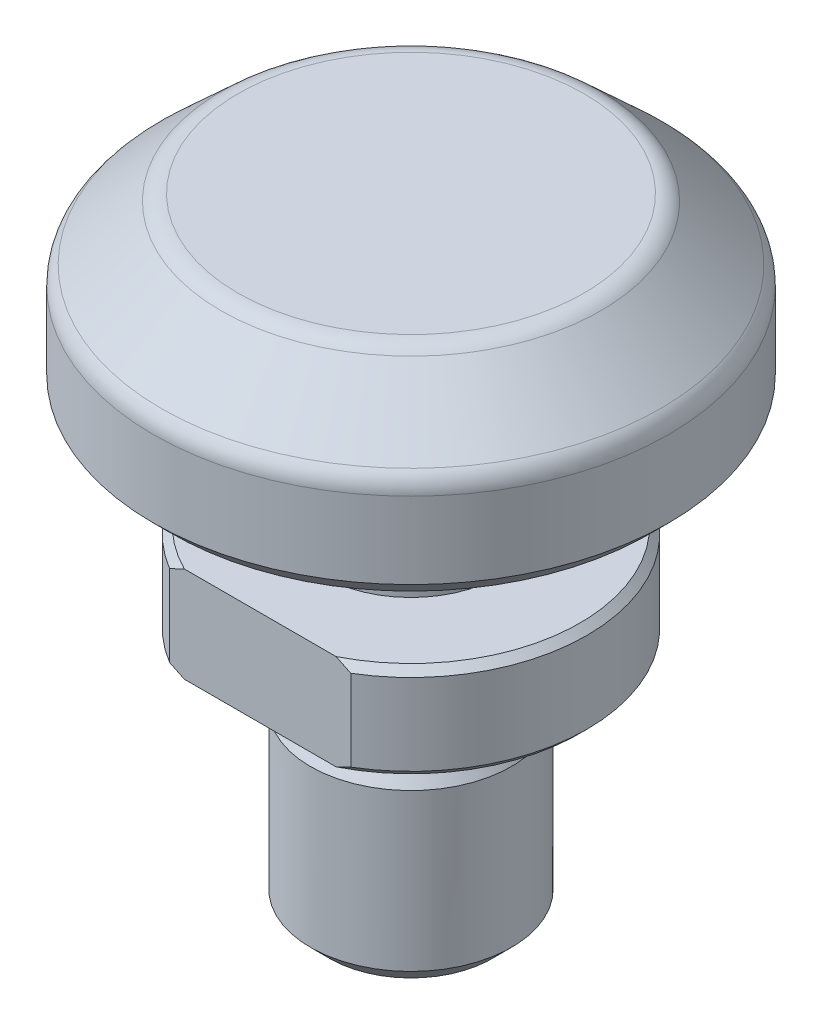
ISO-10303-21;
HEADER;
FILE_DESCRIPTION(('STEP AP214'),'2;1');
FILE_NAME('part.step','',(''),(''),'','','');
FILE_SCHEMA(('AUTOMOTIVE_DESIGN { 1 0 10303 214 1 1 1 1 }'));
ENDSEC;
DATA;
#1=APPLICATION_CONTEXT('core data for automotive mechanical design processes');
#2=APPLICATION_PROTOCOL_DEFINITION('international standard','automotive_design',2000,#1);
#3=PRODUCT_CONTEXT('',#1,'mechanical');
#4=PRODUCT('Part','Part','',(#3));
#5=PRODUCT_RELATED_PRODUCT_CATEGORY('part','',(#4));
#6=PRODUCT_DEFINITION_FORMATION('','',#4);
#7=PRODUCT_DEFINITION_CONTEXT('part definition',#1,'design');
#8=PRODUCT_DEFINITION('design','',#6,#7);
#9=PRODUCT_DEFINITION_SHAPE('','',#8);
#10=(LENGTH_UNIT() NAMED_UNIT(*) SI_UNIT(.MILLI.,.METRE.));
#11=(NAMED_UNIT(*) PLANE_ANGLE_UNIT() SI_UNIT($,.RADIAN.));
#12=(NAMED_UNIT(*) SI_UNIT($,.STERADIAN.) SOLID_ANGLE_UNIT());
#13=UNCERTAINTY_MEASURE_WITH_UNIT(LENGTH_MEASURE(1.E-05),#10,'distance_accuracy_value','');
#14=(GEOMETRIC_REPRESENTATION_CONTEXT(3) GLOBAL_UNCERTAINTY_ASSIGNED_CONTEXT((#13)) GLOBAL_UNIT_ASSIGNED_CONTEXT((#10,
#11,#12)) REPRESENTATION_CONTEXT('',''));
#15=CARTESIAN_POINT('',(0.,0.,0.));
#16=DIRECTION('',(0.,0.,1.));
#17=DIRECTION('',(1.,0.,0.));
#18=AXIS2_PLACEMENT_3D('',#15,#16,#17);
#19=CARTESIAN_POINT('',(-4.,0.,0.));
#20=DIRECTION('',(0.,-1.,0.));
#21=DIRECTION('',(1.,0.,0.));
#22=AXIS2_PLACEMENT_3D('',#19,#20,#21);
#23=PLANE('',#22);
#24=CARTESIAN_POINT('',(0.,0.,0.));
#25=DIRECTION('',(0.,1.,0.));
#26=DIRECTION('',(-1.,0.,0.));
#27=AXIS2_PLACEMENT_3D('',#24,#25,#26);
#28=CIRCLE('',#27,3.23299999996607);
#29=CARTESIAN_POINT('',(-3.23299999996607,0.,0.));
#30=VERTEX_POINT('',#29);
#31=EDGE_CURVE('E20',#30,#30,#28,.T.);
#32=ORIENTED_EDGE('',*,*,#31,.F.);
#33=EDGE_LOOP('',(#32));
#34=FACE_BOUND('',#33,.T.);
#35=ADVANCED_FACE('F17',(#34),#23,.T.);
#36=CARTESIAN_POINT('',(0.,0.766999999996187,0.));
#37=DIRECTION('',(0.,1.,0.));
#38=DIRECTION('',(-1.,0.,0.));
#39=AXIS2_PLACEMENT_3D('',#36,#37,#38);
#40=CONICAL_SURFACE('',#39,3.99999999996226,0.785398163397448);
#41=CARTESIAN_POINT('',(0.,0.767000000016967,0.));
#42=DIRECTION('',(0.,1.,0.));
#43=DIRECTION('',(-1.,0.,0.));
#44=AXIS2_PLACEMENT_3D('',#41,#42,#43);
#45=CIRCLE('',#44,4.);
#46=CARTESIAN_POINT('',(-4.,0.767000000016953,0.));
#47=VERTEX_POINT('',#46);
#48=EDGE_CURVE('E288',#47,#47,#45,.T.);
#49=ORIENTED_EDGE('',*,*,#48,.F.);
#50=EDGE_LOOP('',(#49));
#51=FACE_BOUND('',#50,.T.);
#52=ORIENTED_EDGE('',*,*,#31,.T.);
#53=EDGE_LOOP('',(#52));
#54=FACE_BOUND('',#53,.T.);
#55=ADVANCED_FACE('F308',(#51,#54),#40,.T.);
#56=CARTESIAN_POINT('',(0.,0.,0.));
#57=DIRECTION('',(0.,1.,0.));
#58=DIRECTION('',(-1.,0.,0.));
#59=AXIS2_PLACEMENT_3D('',#56,#57,#58);
#60=CYLINDRICAL_SURFACE('',#59,4.);
#61=CARTESIAN_POINT('',(0.,6.99999999994816,0.));
#62=DIRECTION('',(0.,-1.,0.));
#63=DIRECTION('',(0.,0.,1.));
#64=AXIS2_PLACEMENT_3D('',#61,#62,#63);
#65=CIRCLE('',#64,3.99999999996226);
#66=CARTESIAN_POINT('',(0.,6.99999999994816,3.99999999996226));
#67=VERTEX_POINT('',#66);
#68=EDGE_CURVE('E267',#67,#67,#65,.F.);
#69=ORIENTED_EDGE('',*,*,#68,.F.);
#70=EDGE_LOOP('',(#69));
#71=FACE_BOUND('',#70,.T.);
#72=ORIENTED_EDGE('',*,*,#48,.T.);
#73=EDGE_LOOP('',(#72));
#74=FACE_BOUND('',#73,.T.);
#75=ADVANCED_FACE('F314',(#71,#74),#60,.T.);
#76=CARTESIAN_POINT('',(0.,24.75,0.));
#77=DIRECTION('',(0.,1.,0.));
#78=DIRECTION('',(-1.,0.,0.));
#79=AXIS2_PLACEMENT_3D('',#76,#77,#78);
#80=PLANE('',#79);
#81=CARTESIAN_POINT('',(0.,24.75,0.));
#82=DIRECTION('',(0.,-1.,0.));
#83=DIRECTION('',(0.,0.,-1.));
#84=AXIS2_PLACEMENT_3D('',#81,#82,#83);
#85=CIRCLE('',#84,6.87984949892045);
#86=CARTESIAN_POINT('',(0.,24.75,-6.87984949892045));
#87=VERTEX_POINT('',#86);
#88=EDGE_CURVE('E304',#87,#87,#85,.T.);
#89=ORIENTED_EDGE('',*,*,#88,.F.);
#90=EDGE_LOOP('',(#89));
#91=FACE_BOUND('',#90,.T.);
#92=ADVANCED_FACE('F319',(#91),#80,.T.);
#93=CARTESIAN_POINT('',(0.,6.99999999994816,0.));
#94=DIRECTION('',(0.,-1.,0.));
#95=DIRECTION('',(1.,0.,0.));
#96=AXIS2_PLACEMENT_3D('',#93,#94,#95);
#97=CONICAL_SURFACE('',#96,3.99999999996226,0.576375220607168);
#98=ORIENTED_EDGE('',*,*,#68,.T.);
#99=EDGE_LOOP('',(#98));
#100=FACE_BOUND('',#99,.T.);
#101=CARTESIAN_POINT('',(0.,8.,0.));
#102=DIRECTION('',(0.,1.,0.));
#103=DIRECTION('',(-1.,0.,0.));
#104=AXIS2_PLACEMENT_3D('',#101,#102,#103);
#105=CIRCLE('',#104,3.3499999999809);
#106=CARTESIAN_POINT('',(-3.34999999998093,7.99999999999999,0.));
#107=VERTEX_POINT('',#106);
#108=EDGE_CURVE('E253',#107,#107,#105,.T.);
#109=ORIENTED_EDGE('',*,*,#108,.F.);
#110=EDGE_LOOP('',(#109));
#111=FACE_BOUND('',#110,.T.);
#112=ADVANCED_FACE('F276',(#100,#111),#97,.T.);
#113=CARTESIAN_POINT('',(0.,23.75,0.));
#114=DIRECTION('',(0.,1.,0.));
#115=DIRECTION('',(0.,0.,-1.));
#116=AXIS2_PLACEMENT_3D('',#113,#114,#115);
#117=TOROIDAL_SURFACE('',#116,6.87984949892045,0.999999999999992);
#118=ORIENTED_EDGE('',*,*,#88,.T.);
#119=EDGE_LOOP('',(#118));
#120=FACE_BOUND('',#119,.T.);
#121=CARTESIAN_POINT('',(0.,24.4848034446275,0.));
#122=DIRECTION('',(0.,-1.,0.));
#123=DIRECTION('',(0.,0.,1.));
#124=AXIS2_PLACEMENT_3D('',#121,#122,#123);
#125=CIRCLE('',#124,7.55812960165351);
#126=CARTESIAN_POINT('',(0.,24.4848034446275,7.55812960165351));
#127=VERTEX_POINT('',#126);
#128=EDGE_CURVE('E166',#127,#127,#125,.T.);
#129=ORIENTED_EDGE('',*,*,#128,.F.);
#130=EDGE_LOOP('',(#129));
#131=FACE_BOUND('',#130,.T.);
#132=ADVANCED_FACE('F270',(#120,#131),#117,.T.);
#133=CARTESIAN_POINT('',(0.,9.78284271246821,0.));
#134=DIRECTION('',(0.,1.,0.));
#135=DIRECTION('',(-1.,0.,0.));
#136=AXIS2_PLACEMENT_3D('',#133,#134,#135);
#137=CONICAL_SURFACE('',#136,7.000000000005,0.785398163397448);
#138=CARTESIAN_POINT('',(-3.6055512754666,9.7828427124682,-6.00000000000429));
#139=CARTESIAN_POINT('',(-3.5809237346259,9.77015760994142,-5.99999999899956));
#140=CARTESIAN_POINT('',(-3.5562573251132,9.75754790179966,-5.99999996345259));
#141=CARTESIAN_POINT('',(-3.50700548504324,9.73256488293535,-5.99999986117998));
#142=CARTESIAN_POINT('',(-3.48242056242059,9.72019057078741,-5.99999979465748));
#143=CARTESIAN_POINT('',(-3.43332921506507,9.69567832094102,-5.99999966776473));
#144=CARTESIAN_POINT('',(-3.40882329226819,9.68353937818408,-5.9999996073579));
#145=CARTESIAN_POINT('',(-3.35988740347217,9.6594978779287,-5.99999951829915));
#146=CARTESIAN_POINT('',(-3.33545793265555,9.64759431261466,-5.99999948944943));
#147=CARTESIAN_POINT('',(-3.28667233587404,9.62402356722486,-5.99999947650887));
#148=CARTESIAN_POINT('',(-3.26231669763187,9.61235537782662,-5.99999949214098));
#149=CARTESIAN_POINT('',(-3.21367608698645,9.58925538733103,-5.9999995643274));
#150=CARTESIAN_POINT('',(-3.18939159409844,9.57782257665929,-5.99999962063072));
#151=CARTESIAN_POINT('',(-3.14089052138059,9.5551933378575,-5.99999975306876));
#152=CARTESIAN_POINT('',(-3.11667441213739,9.54399590132312,-5.99999982908211));
#153=CARTESIAN_POINT('',(-3.06830730101743,9.52183742919273,-5.9999999499873));
#154=CARTESIAN_POINT('',(-3.04415675994251,9.51087538768357,-5.99999999506037));
#155=CARTESIAN_POINT('',(-3.0199672225857,9.50000000000272,-6.00000000000446));
#156=B_SPLINE_CURVE_WITH_KNOTS('',3,(#138,#139,#140,#141,#142,#143,#144,#145,#146,#147,#148,
#149,#150,#151,#152,#153,#154,#155),.UNSPECIFIED.,.F.,.F.,(4,2,2,2,2,2,2,2,4),(0.,
0.0831073656591625,0.165677267343585,0.247719658248869,0.329244805119185,0.410263293476938,
0.490786032636817,0.570824260475839,0.650389547929567),.UNSPECIFIED.);
#157=CARTESIAN_POINT('',(-3.60555127546531,9.78284271246683,-6.00000000000214));
#158=VERTEX_POINT('',#157);
#159=CARTESIAN_POINT('',(-3.01996722259013,9.50000000000272,-6.00000000000223));
#160=VERTEX_POINT('',#159);
#161=EDGE_CURVE('E337',#158,#160,#156,.T.);
#162=ORIENTED_EDGE('',*,*,#161,.T.);
#163=CARTESIAN_POINT('',(0.,9.50000000000273,0.));
#164=DIRECTION('',(0.,1.,0.));
#165=DIRECTION('',(-1.,0.,0.));
#166=AXIS2_PLACEMENT_3D('',#163,#164,#165);
#167=CIRCLE('',#166,6.71715728753952);
#168=CARTESIAN_POINT('',(-3.01996722259013,9.50000000000272,6.00000000000223));
#169=VERTEX_POINT('',#168);
#170=EDGE_CURVE('E154',#169,#160,#167,.F.);
#171=ORIENTED_EDGE('',*,*,#170,.F.);
#172=CARTESIAN_POINT('',(-3.0199672225857,9.50000000000272,6.00000000000446));
#173=CARTESIAN_POINT('',(-3.04415675994251,9.51087538768357,5.99999999506037));
#174=CARTESIAN_POINT('',(-3.06830730101743,9.52183742919273,5.99999994998729));
#175=CARTESIAN_POINT('',(-3.1166744121374,9.54399590132312,5.99999982908211));
#176=CARTESIAN_POINT('',(-3.14089052138059,9.5551933378575,5.99999975306876));
#177=CARTESIAN_POINT('',(-3.18939159409843,9.57782257665929,5.99999962063072));
#178=CARTESIAN_POINT('',(-3.21367608698645,9.58925538733103,5.9999995643274));
#179=CARTESIAN_POINT('',(-3.26231669763186,9.61235537782662,5.99999949214098));
#180=CARTESIAN_POINT('',(-3.28667233587404,9.62402356722486,5.99999947650887));
#181=CARTESIAN_POINT('',(-3.33545793265555,9.64759431261466,5.99999948944943));
#182=CARTESIAN_POINT('',(-3.35988740347217,9.6594978779287,5.99999951829915));
#183=CARTESIAN_POINT('',(-3.4088232922682,9.68353937818407,5.9999996073579));
#184=CARTESIAN_POINT('',(-3.43332921506507,9.69567832094101,5.99999966776473));
#185=CARTESIAN_POINT('',(-3.48242056242059,9.7201905707874,5.99999979465748));
#186=CARTESIAN_POINT('',(-3.50700548504324,9.73256488293535,5.99999986117998));
#187=CARTESIAN_POINT('',(-3.5562573251132,9.75754790179966,5.99999996345258));
#188=CARTESIAN_POINT('',(-3.5809237346259,9.77015760994142,5.99999999899956));
#189=CARTESIAN_POINT('',(-3.6055512754666,9.7828427124682,6.00000000000429));
#190=B_SPLINE_CURVE_WITH_KNOTS('',3,(#172,#173,#174,#175,#176,#177,#178,#179,#180,#181,#182,
#183,#184,#185,#186,#187,#188,#189),.UNSPECIFIED.,.F.,.F.,(4,2,2,2,2,2,2,2,4),(0.,
0.0795652874537298,0.159603515292749,0.240126254452625,0.321144742810381,0.402669889680699,
0.484712280585978,0.567282182270402,0.650389547929564),.UNSPECIFIED.);
#191=CARTESIAN_POINT('',(-3.60555127546532,9.78284271246683,6.00000000000214));
#192=VERTEX_POINT('',#191);
#193=EDGE_CURVE('E76',#169,#192,#190,.T.);
#194=ORIENTED_EDGE('',*,*,#193,.T.);
#195=CARTESIAN_POINT('',(0.,9.78284271246547,0.));
#196=DIRECTION('',(0.,-1.,0.));
#197=DIRECTION('',(1.,0.,0.));
#198=AXIS2_PLACEMENT_3D('',#195,#196,#197);
#199=CIRCLE('',#198,7.);
#200=EDGE_CURVE('E156',#158,#192,#199,.F.);
#201=ORIENTED_EDGE('',*,*,#200,.F.);
#202=EDGE_LOOP('',(#162,#171,#194,#201));
#203=FACE_BOUND('',#202,.T.);
#204=ADVANCED_FACE('F275',(#203),#137,.T.);
#205=CARTESIAN_POINT('',(0.,9.78284271252505,0.));
#206=DIRECTION('',(0.,1.,0.));
#207=DIRECTION('',(-1.,0.,0.));
#208=AXIS2_PLACEMENT_3D('',#205,#206,#207);
#209=CONICAL_SURFACE('',#208,7.000000000005,0.785398163296962);
#210=CARTESIAN_POINT('',(3.60555127546653,9.78284271252507,6.00000000000429));
#211=CARTESIAN_POINT('',(3.58092373460594,9.77015760998643,5.99999999900065));
#212=CARTESIAN_POINT('',(3.5562573250734,9.75754790183267,5.99999996345437));
#213=CARTESIAN_POINT('',(3.50700548496954,9.73256488294715,5.99999986118256));
#214=CARTESIAN_POINT('',(3.48242056233285,9.72019057078995,5.99999979466016));
#215=CARTESIAN_POINT('',(3.43332921495497,9.69567832092783,5.9999996677672));
#216=CARTESIAN_POINT('',(3.40882329214979,9.68353937816439,5.99999960736006));
#217=CARTESIAN_POINT('',(3.35988740334282,9.65949787789878,5.99999951830049));
#218=CARTESIAN_POINT('',(3.33545793252357,9.64759431258098,5.99999948945026));
#219=CARTESIAN_POINT('',(3.2866723357424,9.62402356718642,5.99999947650867));
#220=CARTESIAN_POINT('',(3.26231669750321,9.61235537778717,5.99999949214026));
#221=CARTESIAN_POINT('',(3.21367608686927,9.58925538729232,5.99999956432581));
#222=CARTESIAN_POINT('',(3.18939159398978,9.57782257662231,5.99999962062879));
#223=CARTESIAN_POINT('',(3.14089052129444,9.55519333782675,5.99999975306652));
#224=CARTESIAN_POINT('',(3.11667441206524,9.54399590129684,5.9999998290799));
#225=CARTESIAN_POINT('',(3.06830730097866,9.52183742917817,5.99999994998572));
#226=CARTESIAN_POINT('',(3.04415675992314,9.51087538767622,5.99999999505939));
#227=CARTESIAN_POINT('',(3.01996722258565,9.50000000000274,6.00000000000445));
#228=B_SPLINE_CURVE_WITH_KNOTS('',3,(#210,#211,#212,#213,#214,#215,#216,#217,#218,#219,#220,
#221,#222,#223,#224,#225,#226,#227),.UNSPECIFIED.,.F.,.F.,(4,2,2,2,2,2,2,2,4),(0.,
0.0831073657285432,0.165677267463067,0.247719658399333,0.329244805281682,0.41026329363269,
0.49078603276723,0.570824260562508,0.650389547954299),.UNSPECIFIED.);
#229=CARTESIAN_POINT('',(3.60555127546525,9.78284271249527,6.00000000000214));
#230=VERTEX_POINT('',#229);
#231=CARTESIAN_POINT('',(3.01996722259007,9.50000000000273,6.00000000000223));
#232=VERTEX_POINT('',#231);
#233=EDGE_CURVE('E255',#230,#232,#228,.T.);
#234=ORIENTED_EDGE('',*,*,#233,.T.);
#235=CARTESIAN_POINT('',(0.,9.50000000000273,0.));
#236=DIRECTION('',(0.,1.,0.));
#237=DIRECTION('',(-1.,0.,0.));
#238=AXIS2_PLACEMENT_3D('',#235,#236,#237);
#239=CIRCLE('',#238,6.71715728753952);
#240=CARTESIAN_POINT('',(3.01996722259007,9.50000000000273,-6.00000000000223));
#241=VERTEX_POINT('',#240);
#242=EDGE_CURVE('E152',#241,#232,#239,.F.);
#243=ORIENTED_EDGE('',*,*,#242,.F.);
#244=CARTESIAN_POINT('',(3.01996722258565,9.50000000000274,-6.00000000000445));
#245=CARTESIAN_POINT('',(3.04415675992314,9.51087538767622,-5.99999999505939));
#246=CARTESIAN_POINT('',(3.06830730097866,9.52183742917817,-5.99999994998572));
#247=CARTESIAN_POINT('',(3.11667441206525,9.54399590129684,-5.99999982907991));
#248=CARTESIAN_POINT('',(3.14089052129445,9.55519333782675,-5.99999975306652));
#249=CARTESIAN_POINT('',(3.1893915939898,9.57782257662231,-5.99999962062879));
#250=CARTESIAN_POINT('',(3.21367608686929,9.58925538729233,-5.99999956432581));
#251=CARTESIAN_POINT('',(3.26231669750323,9.61235537778717,-5.99999949214026));
#252=CARTESIAN_POINT('',(3.28667233574242,9.62402356718643,-5.99999947650867));
#253=CARTESIAN_POINT('',(3.33545793252359,9.64759431258098,-5.99999948945026));
#254=CARTESIAN_POINT('',(3.35988740334284,9.65949787789879,-5.99999951830049));
#255=CARTESIAN_POINT('',(3.40882329214981,9.68353937816439,-5.99999960736006));
#256=CARTESIAN_POINT('',(3.43332921495499,9.69567832092784,-5.9999996677672));
#257=CARTESIAN_POINT('',(3.48242056233287,9.72019057078995,-5.99999979466016));
#258=CARTESIAN_POINT('',(3.50700548496955,9.73256488294715,-5.99999986118256));
#259=CARTESIAN_POINT('',(3.55625732507341,9.75754790183267,-5.99999996345437));
#260=CARTESIAN_POINT('',(3.58092373460595,9.77015760998643,-5.99999999900065));
#261=CARTESIAN_POINT('',(3.60555127546654,9.78284271252507,-6.00000000000428));
#262=B_SPLINE_CURVE_WITH_KNOTS('',3,(#244,#245,#246,#247,#248,#249,#250,#251,#252,#253,#254,
#255,#256,#257,#258,#259,#260,#261),.UNSPECIFIED.,.F.,.F.,(4,2,2,2,2,2,2,2,4),(0.,
0.0795652873917966,0.159603515187086,0.240126254321632,0.321144742672638,0.40266988955499,
0.484712280491251,0.567282182225769,0.650389547954306),.UNSPECIFIED.);
#263=CARTESIAN_POINT('',(3.60555127546524,9.78284271249527,-6.00000000000214));
#264=VERTEX_POINT('',#263);
#265=EDGE_CURVE('E259',#241,#264,#262,.T.);
#266=ORIENTED_EDGE('',*,*,#265,.T.);
#267=CARTESIAN_POINT('',(0.,9.78284271246547,0.));
#268=DIRECTION('',(0.,-1.,0.));
#269=DIRECTION('',(1.,0.,0.));
#270=AXIS2_PLACEMENT_3D('',#267,#268,#269);
#271=CIRCLE('',#270,7.);
#272=EDGE_CURVE('E161',#230,#264,#271,.F.);
#273=ORIENTED_EDGE('',*,*,#272,.F.);
#274=EDGE_LOOP('',(#234,#243,#266,#273));
#275=FACE_BOUND('',#274,.T.);
#276=ADVANCED_FACE('F352',(#275),#209,.T.);
#277=CARTESIAN_POINT('',(0.,0.,0.));
#278=DIRECTION('',(0.,1.,0.));
#279=DIRECTION('',(-1.,0.,0.));
#280=AXIS2_PLACEMENT_3D('',#277,#278,#279);
#281=CYLINDRICAL_SURFACE('',#280,3.3499999999809);
#282=CARTESIAN_POINT('',(0.,9.5,0.));
#283=DIRECTION('',(0.,1.,0.));
#284=DIRECTION('',(-1.,0.,0.));
#285=AXIS2_PLACEMENT_3D('',#282,#283,#284);
#286=CIRCLE('',#285,3.3499999999809);
#287=CARTESIAN_POINT('',(-3.34999999998093,9.49999999999999,0.));
#288=VERTEX_POINT('',#287);
#289=EDGE_CURVE('E148',#288,#288,#286,.T.);
#290=ORIENTED_EDGE('',*,*,#289,.F.);
#291=EDGE_LOOP('',(#290));
#292=FACE_BOUND('',#291,.T.);
#293=ORIENTED_EDGE('',*,*,#108,.T.);
#294=EDGE_LOOP('',(#293));
#295=FACE_BOUND('',#294,.T.);
#296=ADVANCED_FACE('F248',(#292,#295),#281,.T.);
#297=CARTESIAN_POINT('',(0.,22.2969722128617,0.));
#298=DIRECTION('',(0.,-1.,0.));
#299=DIRECTION('',(1.,0.,0.));
#300=AXIS2_PLACEMENT_3D('',#297,#298,#299);
#301=CONICAL_SURFACE('',#300,9.92828010273309,0.825376850520738);
#302=CARTESIAN_POINT('',(0.,22.2969722128617,0.));
#303=DIRECTION('',(0.,-1.,0.));
#304=DIRECTION('',(0.,0.,1.));
#305=AXIS2_PLACEMENT_3D('',#302,#303,#304);
#306=CIRCLE('',#305,9.92828010273311);
#307=CARTESIAN_POINT('',(0.,22.2969722128617,9.92828010273311));
#308=VERTEX_POINT('',#307);
#309=EDGE_CURVE('E151',#308,#308,#306,.T.);
#310=ORIENTED_EDGE('',*,*,#309,.F.);
#311=EDGE_LOOP('',(#310));
#312=FACE_BOUND('',#311,.T.);
#313=ORIENTED_EDGE('',*,*,#128,.T.);
#314=EDGE_LOOP('',(#313));
#315=FACE_BOUND('',#314,.T.);
#316=ADVANCED_FACE('F244',(#312,#315),#301,.T.);
#317=CARTESIAN_POINT('',(0.,13.3,0.));
#318=DIRECTION('',(0.,-1.,0.));
#319=DIRECTION('',(1.,0.,0.));
#320=AXIS2_PLACEMENT_3D('',#317,#318,#319);
#321=CYLINDRICAL_SURFACE('',#320,7.);
#322=DIRECTION('',(0.,1.,0.));
#323=VECTOR('',#322,1.);
#324=CARTESIAN_POINT('',(3.60555127546396,13.3,6.));
#325=LINE('',#324,#323);
#326=CARTESIAN_POINT('',(3.60555127546395,13.0171572875345,6.));
#327=VERTEX_POINT('',#326);
#328=EDGE_CURVE('E176',#230,#327,#325,.T.);
#329=ORIENTED_EDGE('',*,*,#328,.F.);
#330=ORIENTED_EDGE('',*,*,#272,.T.);
#331=DIRECTION('',(0.,1.,0.));
#332=VECTOR('',#331,1.);
#333=CARTESIAN_POINT('',(3.60555127546394,13.3,-6.));
#334=LINE('',#333,#332);
#335=CARTESIAN_POINT('',(3.60555127546394,13.0171572875345,-6.));
#336=VERTEX_POINT('',#335);
#337=EDGE_CURVE('E173',#336,#264,#334,.F.);
#338=ORIENTED_EDGE('',*,*,#337,.F.);
#339=CARTESIAN_POINT('',(0.,13.0171572875345,0.));
#340=DIRECTION('',(0.,-1.,0.));
#341=DIRECTION('',(0.,0.,1.));
#342=AXIS2_PLACEMENT_3D('',#339,#340,#341);
#343=CIRCLE('',#342,7.00000000000001);
#344=EDGE_CURVE('E174',#327,#336,#343,.F.);
#345=ORIENTED_EDGE('',*,*,#344,.F.);
#346=EDGE_LOOP('',(#329,#330,#338,#345));
#347=FACE_BOUND('',#346,.T.);
#348=ADVANCED_FACE('F247',(#347),#321,.T.);
#349=CARTESIAN_POINT('',(0.,13.3,0.));
#350=DIRECTION('',(0.,-1.,0.));
#351=DIRECTION('',(1.,0.,0.));
#352=AXIS2_PLACEMENT_3D('',#349,#350,#351);
#353=CYLINDRICAL_SURFACE('',#352,7.);
#354=DIRECTION('',(0.,1.,0.));
#355=VECTOR('',#354,1.);
#356=CARTESIAN_POINT('',(-3.60555127546404,13.3,6.));
#357=LINE('',#356,#355);
#358=CARTESIAN_POINT('',(-3.60555127546403,13.0171572875345,6.));
#359=VERTEX_POINT('',#358);
#360=EDGE_CURVE('E97',#359,#192,#357,.F.);
#361=ORIENTED_EDGE('',*,*,#360,.F.);
#362=CARTESIAN_POINT('',(0.,13.0171572875345,0.));
#363=DIRECTION('',(0.,-1.,0.));
#364=DIRECTION('',(0.,0.,1.));
#365=AXIS2_PLACEMENT_3D('',#362,#363,#364);
#366=CIRCLE('',#365,6.99999999999999);
#367=CARTESIAN_POINT('',(-3.60555127546402,13.0171572875345,-6.));
#368=VERTEX_POINT('',#367);
#369=EDGE_CURVE('E86',#368,#359,#366,.F.);
#370=ORIENTED_EDGE('',*,*,#369,.F.);
#371=DIRECTION('',(0.,1.,0.));
#372=VECTOR('',#371,1.);
#373=CARTESIAN_POINT('',(-3.60555127546402,13.3,-6.));
#374=LINE('',#373,#372);
#375=EDGE_CURVE('E147',#158,#368,#374,.T.);
#376=ORIENTED_EDGE('',*,*,#375,.F.);
#377=ORIENTED_EDGE('',*,*,#200,.T.);
#378=EDGE_LOOP('',(#361,#370,#376,#377));
#379=FACE_BOUND('',#378,.T.);
#380=ADVANCED_FACE('F368',(#379),#353,.T.);
#381=CARTESIAN_POINT('',(0.,9.5,0.));
#382=DIRECTION('',(0.,-1.,0.));
#383=DIRECTION('',(1.,0.,0.));
#384=AXIS2_PLACEMENT_3D('',#381,#382,#383);
#385=PLANE('',#384);
#386=ORIENTED_EDGE('',*,*,#289,.T.);
#387=EDGE_LOOP('',(#386));
#388=FACE_BOUND('',#387,.T.);
#389=DIRECTION('',(-1.,0.,0.));
#390=VECTOR('',#389,1.);
#391=CARTESIAN_POINT('',(-3.60555127546403,9.50000000000001,-6.));
#392=LINE('',#391,#390);
#393=EDGE_CURVE('E236',#241,#160,#392,.T.);
#394=ORIENTED_EDGE('',*,*,#393,.F.);
#395=ORIENTED_EDGE('',*,*,#242,.T.);
#396=DIRECTION('',(1.,0.,0.));
#397=VECTOR('',#396,1.);
#398=CARTESIAN_POINT('',(3.60555127546394,9.49999999999999,6.));
#399=LINE('',#398,#397);
#400=EDGE_CURVE('E114',#169,#232,#399,.T.);
#401=ORIENTED_EDGE('',*,*,#400,.F.);
#402=ORIENTED_EDGE('',*,*,#170,.T.);
#403=EDGE_LOOP('',(#394,#395,#401,#402));
#404=FACE_BOUND('',#403,.T.);
#405=ADVANCED_FACE('F371',(#388,#404),#385,.T.);
#406=CARTESIAN_POINT('',(0.,21.5621687682343,0.));
#407=DIRECTION('',(0.,-1.,0.));
#408=DIRECTION('',(0.,0.,1.));
#409=AXIS2_PLACEMENT_3D('',#406,#407,#408);
#410=TOROIDAL_SURFACE('',#409,9.25000000000001,0.999999999999992);
#411=CARTESIAN_POINT('',(0.,21.5621687682343,0.));
#412=DIRECTION('',(0.,1.,0.));
#413=DIRECTION('',(-1.,0.,0.));
#414=AXIS2_PLACEMENT_3D('',#411,#412,#413);
#415=CIRCLE('',#414,10.25);
#416=CARTESIAN_POINT('',(-10.2500000000001,21.5621687682343,0.));
#417=VERTEX_POINT('',#416);
#418=EDGE_CURVE('E110',#417,#417,#415,.F.);
#419=ORIENTED_EDGE('',*,*,#418,.F.);
#420=EDGE_LOOP('',(#419));
#421=FACE_BOUND('',#420,.T.);
#422=ORIENTED_EDGE('',*,*,#309,.T.);
#423=EDGE_LOOP('',(#422));
#424=FACE_BOUND('',#423,.T.);
#425=ADVANCED_FACE('F136',(#421,#424),#410,.T.);
#426=CARTESIAN_POINT('',(0.,13.0171572875345,0.));
#427=DIRECTION('',(0.,-1.,0.));
#428=DIRECTION('',(1.,0.,0.));
#429=AXIS2_PLACEMENT_3D('',#426,#427,#428);
#430=CONICAL_SURFACE('',#429,6.99999999999999,0.785398163397451);
#431=CARTESIAN_POINT('',(-3.60555127546403,13.0171572875345,-6.));
#432=CARTESIAN_POINT('',(-3.55736429107244,13.0419770896372,-6.));
#433=CARTESIAN_POINT('',(-3.50902833538967,13.0665086415608,-6.));
#434=CARTESIAN_POINT('',(-3.41205945493532,13.1149558224307,-6.));
#435=CARTESIAN_POINT('',(-3.36342658397676,13.1388715591148,-6.));
#436=CARTESIAN_POINT('',(-3.26584730473928,13.1860567316739,-6.));
#437=CARTESIAN_POINT('',(-3.21690089280317,13.2093261599933,-6.));
#438=CARTESIAN_POINT('',(-3.11867982110624,13.2551843272843,-6.));
#439=CARTESIAN_POINT('',(-3.06940510502931,13.2777729455995,-6.));
#440=CARTESIAN_POINT('',(-3.01996722258347,13.3000000000001,-6.));
#441=B_SPLINE_CURVE_WITH_KNOTS('',3,(#431,#432,#433,#434,#435,#436,#437,#438,#439,#440),
.UNSPECIFIED.,.F.,.F.,(4,2,2,2,4),(0.,0.162609856394125,0.325191067975581,0.487774179403329,
0.650385937164525),.UNSPECIFIED.);
#442=CARTESIAN_POINT('',(-3.01996722258341,13.3,-6.));
#443=VERTEX_POINT('',#442);
#444=EDGE_CURVE('E141',#368,#443,#441,.T.);
#445=ORIENTED_EDGE('',*,*,#444,.F.);
#446=ORIENTED_EDGE('',*,*,#369,.T.);
#447=CARTESIAN_POINT('',(-3.01996722258341,13.3,6.));
#448=CARTESIAN_POINT('',(-3.06940510502929,13.2777729455994,6.));
#449=CARTESIAN_POINT('',(-3.11867982110623,13.2551843272843,6.));
#450=CARTESIAN_POINT('',(-3.21690089280318,13.2093261599933,6.));
#451=CARTESIAN_POINT('',(-3.26584730473929,13.1860567316739,6.));
#452=CARTESIAN_POINT('',(-3.36342658397676,13.1388715591148,6.));
#453=CARTESIAN_POINT('',(-3.41205945493532,13.1149558224307,6.));
#454=CARTESIAN_POINT('',(-3.50902833538967,13.0665086415608,6.));
#455=CARTESIAN_POINT('',(-3.55736429107245,13.0419770896373,6.));
#456=CARTESIAN_POINT('',(-3.60555127546405,13.0171572875345,6.));
#457=B_SPLINE_CURVE_WITH_KNOTS('',3,(#447,#448,#449,#450,#451,#452,#453,#454,#455,#456),
.UNSPECIFIED.,.F.,.F.,(4,2,2,2,4),(0.,0.162611757761199,0.325194869188953,0.487776080770409,
0.650385937164537),.UNSPECIFIED.);
#458=CARTESIAN_POINT('',(-3.01996722258341,13.3,6.));
#459=VERTEX_POINT('',#458);
#460=EDGE_CURVE('E91',#459,#359,#457,.T.);
#461=ORIENTED_EDGE('',*,*,#460,.F.);
#462=CARTESIAN_POINT('',(0.,13.3,0.));
#463=DIRECTION('',(0.,-1.,0.));
#464=DIRECTION('',(1.,0.,0.));
#465=AXIS2_PLACEMENT_3D('',#462,#463,#464);
#466=CIRCLE('',#465,6.7171572875345);
#467=EDGE_CURVE('E95',#459,#443,#466,.T.);
#468=ORIENTED_EDGE('',*,*,#467,.T.);
#469=EDGE_LOOP('',(#445,#446,#461,#468));
#470=FACE_BOUND('',#469,.T.);
#471=ADVANCED_FACE('F93',(#470),#430,.T.);
#472=CARTESIAN_POINT('',(-3.60555127546403,13.3,-6.));
#473=DIRECTION('',(0.,0.,-1.));
#474=DIRECTION('',(-1.,0.,0.));
#475=AXIS2_PLACEMENT_3D('',#472,#473,#474);
#476=PLANE('',#475);
#477=ORIENTED_EDGE('',*,*,#375,.T.);
#478=ORIENTED_EDGE('',*,*,#444,.T.);
#479=DIRECTION('',(1.,0.,0.));
#480=VECTOR('',#479,1.);
#481=CARTESIAN_POINT('',(0.,13.3,-6.));
#482=LINE('',#481,#480);
#483=CARTESIAN_POINT('',(3.01996722258332,13.3,-6.));
#484=VERTEX_POINT('',#483);
#485=EDGE_CURVE('E109',#443,#484,#482,.T.);
#486=ORIENTED_EDGE('',*,*,#485,.T.);
#487=CARTESIAN_POINT('',(3.60555127546394,13.0171572875345,-6.00000000000001));
#488=CARTESIAN_POINT('',(3.580923734624,13.0298423900593,-5.99999999899711));
#489=CARTESIAN_POINT('',(3.55625732511212,13.0424520981993,-5.99999996345174));
#490=CARTESIAN_POINT('',(3.50700548504355,13.0674351170605,-5.99999986118192));
#491=CARTESIAN_POINT('',(3.48242056242148,13.0798094292071,-5.99999979466057));
#492=CARTESIAN_POINT('',(3.43332921506685,13.1043216790515,-5.9999996677697));
#493=CARTESIAN_POINT('',(3.4088232922703,13.1164606218076,-5.99999960736357));
#494=CARTESIAN_POINT('',(3.35988740347469,13.140502122062,-5.99999951830577));
#495=CARTESIAN_POINT('',(3.33545793265816,13.1524056873757,-5.99999948945629));
#496=CARTESIAN_POINT('',(3.28667233587661,13.1759764327655,-5.99999947651575));
#497=CARTESIAN_POINT('',(3.2623166976343,13.187644622164,-5.99999949214764));
#498=CARTESIAN_POINT('',(3.21367608698841,13.2107446126607,-5.99999956433313));
#499=CARTESIAN_POINT('',(3.18939159410006,13.2221774233332,-5.99999962063575));
#500=CARTESIAN_POINT('',(3.14089052138134,13.244806662137,-5.99999975307191));
#501=CARTESIAN_POINT('',(3.11667441213762,13.2560040986727,-5.99999982908408));
#502=CARTESIAN_POINT('',(3.0683073010164,13.2781625708062,-5.99999994998642));
#503=CARTESIAN_POINT('',(3.04415675994077,13.2891246123172,-5.99999999505783));
#504=CARTESIAN_POINT('',(3.01996722258332,13.3,-6.));
#505=B_SPLINE_CURVE_WITH_KNOTS('',3,(#487,#488,#489,#490,#491,#492,#493,#494,#495,#496,#497,
#498,#499,#500,#501,#502,#503,#504),.UNSPECIFIED.,.F.,.F.,(4,2,2,2,2,2,2,2,4),(0.,
0.0831073656544893,0.165677267335641,0.247719658239021,0.329244805108754,0.410263293467201,
0.490786032628988,0.570824260471089,0.650389547929014),.UNSPECIFIED.);
#506=EDGE_CURVE('E146',#336,#484,#505,.T.);
#507=ORIENTED_EDGE('',*,*,#506,.F.);
#508=ORIENTED_EDGE('',*,*,#337,.T.);
#509=ORIENTED_EDGE('',*,*,#265,.F.);
#510=ORIENTED_EDGE('',*,*,#393,.T.);
#511=ORIENTED_EDGE('',*,*,#161,.F.);
#512=EDGE_LOOP('',(#477,#478,#486,#507,#508,#509,#510,#511));
#513=FACE_BOUND('',#512,.T.);
#514=ADVANCED_FACE('F135',(#513),#476,.T.);
#515=CARTESIAN_POINT('',(0.,13.0171572875345,0.));
#516=DIRECTION('',(0.,-1.,0.));
#517=DIRECTION('',(1.,0.,0.));
#518=AXIS2_PLACEMENT_3D('',#515,#516,#517);
#519=CONICAL_SURFACE('',#518,7.00000000000001,0.785398163397454);
#520=CARTESIAN_POINT('',(3.60555127546395,13.0171572875345,6.));
#521=CARTESIAN_POINT('',(3.55736429107235,13.0419770896373,6.));
#522=CARTESIAN_POINT('',(3.50902833538959,13.0665086415608,6.));
#523=CARTESIAN_POINT('',(3.41205945493524,13.1149558224308,6.));
#524=CARTESIAN_POINT('',(3.36342658397667,13.1388715591148,6.));
#525=CARTESIAN_POINT('',(3.2658473047392,13.1860567316739,6.));
#526=CARTESIAN_POINT('',(3.21690089280308,13.2093261599933,6.));
#527=CARTESIAN_POINT('',(3.11867982110615,13.2551843272843,6.));
#528=CARTESIAN_POINT('',(3.06940510502922,13.2777729455995,6.));
#529=CARTESIAN_POINT('',(3.01996722258337,13.3000000000001,6.));
#530=B_SPLINE_CURVE_WITH_KNOTS('',3,(#520,#521,#522,#523,#524,#525,#526,#527,#528,#529),
.UNSPECIFIED.,.F.,.F.,(4,2,2,2,4),(0.,0.162609856394129,0.325191067975588,0.487774179403339,
0.650385937164537),.UNSPECIFIED.);
#531=CARTESIAN_POINT('',(3.01996722258332,13.3,6.));
#532=VERTEX_POINT('',#531);
#533=EDGE_CURVE('E98',#327,#532,#530,.T.);
#534=ORIENTED_EDGE('',*,*,#533,.F.);
#535=ORIENTED_EDGE('',*,*,#344,.T.);
#536=ORIENTED_EDGE('',*,*,#506,.T.);
#537=CARTESIAN_POINT('',(0.,13.3,0.));
#538=DIRECTION('',(0.,-1.,0.));
#539=DIRECTION('',(1.,0.,0.));
#540=AXIS2_PLACEMENT_3D('',#537,#538,#539);
#541=CIRCLE('',#540,6.71715728753451);
#542=EDGE_CURVE('E35',#484,#532,#541,.T.);
#543=ORIENTED_EDGE('',*,*,#542,.T.);
#544=EDGE_LOOP('',(#534,#535,#536,#543));
#545=FACE_BOUND('',#544,.T.);
#546=ADVANCED_FACE('F181',(#545),#519,.T.);
#547=CARTESIAN_POINT('',(3.60555127546394,13.3,6.));
#548=DIRECTION('',(0.,0.,1.));
#549=DIRECTION('',(1.,0.,0.));
#550=AXIS2_PLACEMENT_3D('',#547,#548,#549);
#551=PLANE('',#550);
#552=ORIENTED_EDGE('',*,*,#400,.T.);
#553=ORIENTED_EDGE('',*,*,#233,.F.);
#554=ORIENTED_EDGE('',*,*,#328,.T.);
#555=ORIENTED_EDGE('',*,*,#533,.T.);
#556=DIRECTION('',(1.,0.,0.));
#557=VECTOR('',#556,1.);
#558=CARTESIAN_POINT('',(0.,13.3,6.));
#559=LINE('',#558,#557);
#560=EDGE_CURVE('E101',#532,#459,#559,.F.);
#561=ORIENTED_EDGE('',*,*,#560,.T.);
#562=ORIENTED_EDGE('',*,*,#460,.T.);
#563=ORIENTED_EDGE('',*,*,#360,.T.);
#564=ORIENTED_EDGE('',*,*,#193,.F.);
#565=EDGE_LOOP('',(#552,#553,#554,#555,#561,#562,#563,#564));
#566=FACE_BOUND('',#565,.T.);
#567=ADVANCED_FACE('F102',(#566),#551,.T.);
#568=CARTESIAN_POINT('',(0.,13.3,0.));
#569=DIRECTION('',(0.,1.,0.));
#570=DIRECTION('',(-1.,0.,0.));
#571=AXIS2_PLACEMENT_3D('',#568,#569,#570);
#572=CYLINDRICAL_SURFACE('',#571,10.25);
#573=ORIENTED_EDGE('',*,*,#418,.T.);
#574=EDGE_LOOP('',(#573));
#575=FACE_BOUND('',#574,.T.);
#576=CARTESIAN_POINT('',(0.,18.517000000017,0.));
#577=DIRECTION('',(0.,1.,0.));
#578=DIRECTION('',(0.,0.,-1.));
#579=AXIS2_PLACEMENT_3D('',#576,#577,#578);
#580=CIRCLE('',#579,10.25);
#581=CARTESIAN_POINT('',(0.,18.517000000017,-10.25));
#582=VERTEX_POINT('',#581);
#583=EDGE_CURVE('E105',#582,#582,#580,.F.);
#584=ORIENTED_EDGE('',*,*,#583,.F.);
#585=EDGE_LOOP('',(#584));
#586=FACE_BOUND('',#585,.T.);
#587=ADVANCED_FACE('F195',(#575,#586),#572,.T.);
#588=CARTESIAN_POINT('',(0.,13.3,0.));
#589=DIRECTION('',(0.,-1.,0.));
#590=DIRECTION('',(1.,0.,0.));
#591=AXIS2_PLACEMENT_3D('',#588,#589,#590);
#592=PLANE('',#591);
#593=CARTESIAN_POINT('',(0.,13.3,0.));
#594=DIRECTION('',(0.,1.,0.));
#595=DIRECTION('',(-1.,0.,0.));
#596=AXIS2_PLACEMENT_3D('',#593,#594,#595);
#597=CIRCLE('',#596,3.5);
#598=CARTESIAN_POINT('',(-3.50000000000005,13.3,0.));
#599=VERTEX_POINT('',#598);
#600=EDGE_CURVE('E223',#599,#599,#597,.T.);
#601=ORIENTED_EDGE('',*,*,#600,.F.);
#602=EDGE_LOOP('',(#601));
#603=FACE_BOUND('',#602,.T.);
#604=ORIENTED_EDGE('',*,*,#542,.F.);
#605=ORIENTED_EDGE('',*,*,#485,.F.);
#606=ORIENTED_EDGE('',*,*,#467,.F.);
#607=ORIENTED_EDGE('',*,*,#560,.F.);
#608=EDGE_LOOP('',(#604,#605,#606,#607));
#609=FACE_BOUND('',#608,.T.);
#610=ADVANCED_FACE('F108',(#603,#609),#592,.F.);
#611=CARTESIAN_POINT('',(0.,18.517000000017,0.));
#612=DIRECTION('',(0.,1.,0.));
#613=DIRECTION('',(-1.,0.,0.));
#614=AXIS2_PLACEMENT_3D('',#611,#612,#613);
#615=CONICAL_SURFACE('',#614,10.25,0.785398163397456);
#616=ORIENTED_EDGE('',*,*,#583,.T.);
#617=EDGE_LOOP('',(#616));
#618=FACE_BOUND('',#617,.T.);
#619=CARTESIAN_POINT('',(0.,17.75,0.));
#620=DIRECTION('',(0.,1.,0.));
#621=DIRECTION('',(-1.,0.,0.));
#622=AXIS2_PLACEMENT_3D('',#619,#620,#621);
#623=CIRCLE('',#622,9.48299999998301);
#624=CARTESIAN_POINT('',(-9.48299999998307,17.75,0.));
#625=VERTEX_POINT('',#624);
#626=EDGE_CURVE('E26',#625,#625,#623,.F.);
#627=ORIENTED_EDGE('',*,*,#626,.F.);
#628=EDGE_LOOP('',(#627));
#629=FACE_BOUND('',#628,.T.);
#630=ADVANCED_FACE('F205',(#618,#629),#615,.T.);
#631=CARTESIAN_POINT('',(0.,13.3,0.));
#632=DIRECTION('',(0.,1.,0.));
#633=DIRECTION('',(-1.,0.,0.));
#634=AXIS2_PLACEMENT_3D('',#631,#632,#633);
#635=CYLINDRICAL_SURFACE('',#634,3.5);
#636=CARTESIAN_POINT('',(0.,17.75,0.));
#637=DIRECTION('',(0.,1.,0.));
#638=DIRECTION('',(-1.,0.,0.));
#639=AXIS2_PLACEMENT_3D('',#636,#637,#638);
#640=CIRCLE('',#639,3.5);
#641=CARTESIAN_POINT('',(-3.50000000000006,17.75,0.));
#642=VERTEX_POINT('',#641);
#643=EDGE_CURVE('E11',#642,#642,#640,.T.);
#644=ORIENTED_EDGE('',*,*,#643,.F.);
#645=EDGE_LOOP('',(#644));
#646=FACE_BOUND('',#645,.T.);
#647=ORIENTED_EDGE('',*,*,#600,.T.);
#648=EDGE_LOOP('',(#647));
#649=FACE_BOUND('',#648,.T.);
#650=ADVANCED_FACE('F199',(#646,#649),#635,.T.);
#651=CARTESIAN_POINT('',(-10.2500000000001,17.75,0.));
#652=DIRECTION('',(0.,-1.,0.));
#653=DIRECTION('',(1.,0.,0.));
#654=AXIS2_PLACEMENT_3D('',#651,#652,#653);
#655=PLANE('',#654);
#656=ORIENTED_EDGE('',*,*,#643,.T.);
#657=EDGE_LOOP('',(#656));
#658=FACE_BOUND('',#657,.T.);
#659=ORIENTED_EDGE('',*,*,#626,.T.);
#660=EDGE_LOOP('',(#659));
#661=FACE_BOUND('',#660,.T.);
#662=ADVANCED_FACE('F197',(#658,#661),#655,.T.);
#663=CLOSED_SHELL('',(#35,#55,#75,#92,#112,#132,#204,#276,#296,#316,#348,#380,#405,#425,#471,
#514,#546,#567,#587,#610,#630,#650,#662));
#664=MANIFOLD_SOLID_BREP('B1',#663);
#665=ADVANCED_BREP_SHAPE_REPRESENTATION('',(#18,#664),#14);
#666=SHAPE_DEFINITION_REPRESENTATION(#9,#665);
ENDSEC;
END-ISO-10303-21;
